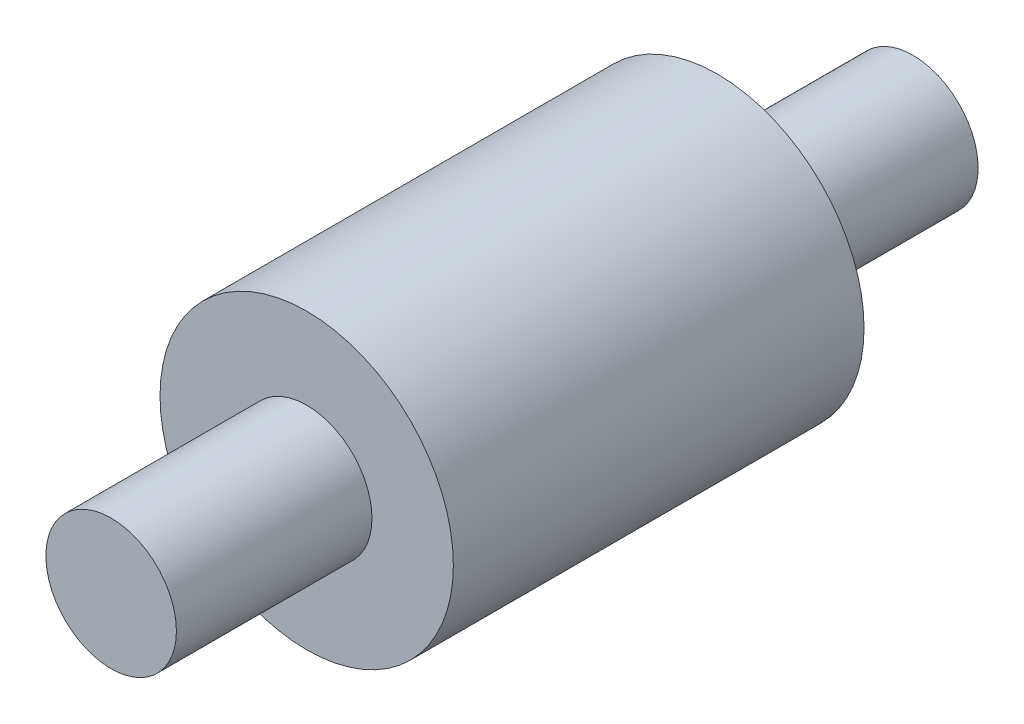
ISO-10303-21;
HEADER;
FILE_DESCRIPTION(('STEP AP214'),'2;1');
FILE_NAME('part.step','',(''),(''),'','','');
FILE_SCHEMA(('AUTOMOTIVE_DESIGN { 1 0 10303 214 1 1 1 1 }'));
ENDSEC;
DATA;
#1=APPLICATION_CONTEXT('core data for automotive mechanical design processes');
#2=APPLICATION_PROTOCOL_DEFINITION('international standard','automotive_design',2000,#1);
#3=PRODUCT_CONTEXT('',#1,'mechanical');
#4=PRODUCT('Part','Part','',(#3));
#5=PRODUCT_RELATED_PRODUCT_CATEGORY('part','',(#4));
#6=PRODUCT_DEFINITION_FORMATION('','',#4);
#7=PRODUCT_DEFINITION_CONTEXT('part definition',#1,'design');
#8=PRODUCT_DEFINITION('design','',#6,#7);
#9=PRODUCT_DEFINITION_SHAPE('','',#8);
#10=(LENGTH_UNIT() NAMED_UNIT(*) SI_UNIT(.MILLI.,.METRE.));
#11=(NAMED_UNIT(*) PLANE_ANGLE_UNIT() SI_UNIT($,.RADIAN.));
#12=(NAMED_UNIT(*) SI_UNIT($,.STERADIAN.) SOLID_ANGLE_UNIT());
#13=UNCERTAINTY_MEASURE_WITH_UNIT(LENGTH_MEASURE(1.E-05),#10,'distance_accuracy_value','');
#14=(GEOMETRIC_REPRESENTATION_CONTEXT(3) GLOBAL_UNCERTAINTY_ASSIGNED_CONTEXT((#13)) GLOBAL_UNIT_ASSIGNED_CONTEXT((#10,
#11,#12)) REPRESENTATION_CONTEXT('',''));
#15=CARTESIAN_POINT('',(0.,0.,0.));
#16=DIRECTION('',(0.,0.,1.));
#17=DIRECTION('',(1.,0.,0.));
#18=AXIS2_PLACEMENT_3D('',#15,#16,#17);
#19=CARTESIAN_POINT('',(0.,0.,6.3));
#20=DIRECTION('',(0.,0.,-1.));
#21=DIRECTION('',(-1.,0.,0.));
#22=AXIS2_PLACEMENT_3D('',#19,#20,#21);
#23=CYLINDRICAL_SURFACE('',#22,2.25);
#24=CARTESIAN_POINT('',(0.,0.,6.3));
#25=DIRECTION('',(0.,0.,1.));
#26=DIRECTION('',(1.,0.,0.));
#27=AXIS2_PLACEMENT_3D('',#24,#25,#26);
#28=CIRCLE('',#27,2.25);
#29=CARTESIAN_POINT('',(2.25,0.,6.3));
#30=VERTEX_POINT('',#29);
#31=EDGE_CURVE('E55',#30,#30,#28,.T.);
#32=ORIENTED_EDGE('',*,*,#31,.F.);
#33=EDGE_LOOP('',(#32));
#34=FACE_BOUND('',#33,.T.);
#35=CARTESIAN_POINT('',(0.,0.,0.));
#36=DIRECTION('',(0.,0.,1.));
#37=DIRECTION('',(1.,0.,0.));
#38=AXIS2_PLACEMENT_3D('',#35,#36,#37);
#39=CIRCLE('',#38,2.25);
#40=CARTESIAN_POINT('',(2.25,0.,0.));
#41=VERTEX_POINT('',#40);
#42=EDGE_CURVE('E44',#41,#41,#39,.T.);
#43=ORIENTED_EDGE('',*,*,#42,.T.);
#44=EDGE_LOOP('',(#43));
#45=FACE_BOUND('',#44,.T.);
#46=ADVANCED_FACE('F41',(#34,#45),#23,.T.);
#47=CARTESIAN_POINT('',(0.,0.,6.3));
#48=DIRECTION('',(0.,0.,1.));
#49=DIRECTION('',(1.,0.,0.));
#50=AXIS2_PLACEMENT_3D('',#47,#48,#49);
#51=PLANE('',#50);
#52=CARTESIAN_POINT('',(0.,0.,6.3));
#53=DIRECTION('',(0.,0.,1.));
#54=DIRECTION('',(1.,0.,0.));
#55=AXIS2_PLACEMENT_3D('',#52,#53,#54);
#56=CIRCLE('',#55,1.00121614606508);
#57=CARTESIAN_POINT('',(1.00121614606508,0.,6.3));
#58=VERTEX_POINT('',#57);
#59=EDGE_CURVE('E49',#58,#58,#56,.T.);
#60=ORIENTED_EDGE('',*,*,#59,.F.);
#61=EDGE_LOOP('',(#60));
#62=FACE_BOUND('',#61,.T.);
#63=ORIENTED_EDGE('',*,*,#31,.T.);
#64=EDGE_LOOP('',(#63));
#65=FACE_BOUND('',#64,.T.);
#66=ADVANCED_FACE('F75',(#62,#65),#51,.T.);
#67=CARTESIAN_POINT('',(0.,0.,0.));
#68=DIRECTION('',(0.,0.,1.));
#69=DIRECTION('',(1.,0.,0.));
#70=AXIS2_PLACEMENT_3D('',#67,#68,#69);
#71=PLANE('',#70);
#72=CARTESIAN_POINT('',(0.,0.,0.));
#73=DIRECTION('',(0.,0.,-1.));
#74=DIRECTION('',(-1.,0.,0.));
#75=AXIS2_PLACEMENT_3D('',#72,#73,#74);
#76=CIRCLE('',#75,1.);
#77=CARTESIAN_POINT('',(-1.,0.,0.));
#78=VERTEX_POINT('',#77);
#79=EDGE_CURVE('E10',#78,#78,#76,.T.);
#80=ORIENTED_EDGE('',*,*,#79,.F.);
#81=EDGE_LOOP('',(#80));
#82=FACE_BOUND('',#81,.T.);
#83=ORIENTED_EDGE('',*,*,#42,.F.);
#84=EDGE_LOOP('',(#83));
#85=FACE_BOUND('',#84,.T.);
#86=ADVANCED_FACE('F72',(#82,#85),#71,.F.);
#87=CARTESIAN_POINT('',(0.,0.,9.3));
#88=DIRECTION('',(0.,0.,-1.));
#89=DIRECTION('',(-1.,0.,0.));
#90=AXIS2_PLACEMENT_3D('',#87,#88,#89);
#91=CYLINDRICAL_SURFACE('',#90,1.00121614606508);
#92=CARTESIAN_POINT('',(0.,0.,9.3));
#93=DIRECTION('',(0.,0.,1.));
#94=DIRECTION('',(1.,0.,0.));
#95=AXIS2_PLACEMENT_3D('',#92,#93,#94);
#96=CIRCLE('',#95,1.00121614606508);
#97=CARTESIAN_POINT('',(1.00121614606508,0.,9.3));
#98=VERTEX_POINT('',#97);
#99=EDGE_CURVE('E60',#98,#98,#96,.T.);
#100=ORIENTED_EDGE('',*,*,#99,.F.);
#101=EDGE_LOOP('',(#100));
#102=FACE_BOUND('',#101,.T.);
#103=ORIENTED_EDGE('',*,*,#59,.T.);
#104=EDGE_LOOP('',(#103));
#105=FACE_BOUND('',#104,.T.);
#106=ADVANCED_FACE('F74',(#102,#105),#91,.T.);
#107=CARTESIAN_POINT('',(0.,0.,9.3));
#108=DIRECTION('',(0.,0.,1.));
#109=DIRECTION('',(1.,0.,0.));
#110=AXIS2_PLACEMENT_3D('',#107,#108,#109);
#111=PLANE('',#110);
#112=ORIENTED_EDGE('',*,*,#99,.T.);
#113=EDGE_LOOP('',(#112));
#114=FACE_BOUND('',#113,.T.);
#115=ADVANCED_FACE('F81',(#114),#111,.T.);
#116=CARTESIAN_POINT('',(0.,0.,-3.));
#117=DIRECTION('',(0.,0.,1.));
#118=DIRECTION('',(1.,0.,0.));
#119=AXIS2_PLACEMENT_3D('',#116,#117,#118);
#120=CYLINDRICAL_SURFACE('',#119,1.);
#121=CARTESIAN_POINT('',(0.,0.,-3.));
#122=DIRECTION('',(0.,0.,-1.));
#123=DIRECTION('',(-1.,0.,0.));
#124=AXIS2_PLACEMENT_3D('',#121,#122,#123);
#125=CIRCLE('',#124,1.);
#126=CARTESIAN_POINT('',(-1.,0.,-3.));
#127=VERTEX_POINT('',#126);
#128=EDGE_CURVE('E59',#127,#127,#125,.T.);
#129=ORIENTED_EDGE('',*,*,#128,.F.);
#130=EDGE_LOOP('',(#129));
#131=FACE_BOUND('',#130,.T.);
#132=ORIENTED_EDGE('',*,*,#79,.T.);
#133=EDGE_LOOP('',(#132));
#134=FACE_BOUND('',#133,.T.);
#135=ADVANCED_FACE('F111',(#131,#134),#120,.T.);
#136=CARTESIAN_POINT('',(0.,0.,-3.));
#137=DIRECTION('',(0.,0.,-1.));
#138=DIRECTION('',(-1.,0.,0.));
#139=AXIS2_PLACEMENT_3D('',#136,#137,#138);
#140=PLANE('',#139);
#141=ORIENTED_EDGE('',*,*,#128,.T.);
#142=EDGE_LOOP('',(#141));
#143=FACE_BOUND('',#142,.T.);
#144=ADVANCED_FACE('F127',(#143),#140,.T.);
#145=CLOSED_SHELL('',(#46,#66,#86,#106,#115,#135,#144));
#146=MANIFOLD_SOLID_BREP('B2',#145);
#147=ADVANCED_BREP_SHAPE_REPRESENTATION('',(#18,#146),#14);
#148=SHAPE_DEFINITION_REPRESENTATION(#9,#147);
ENDSEC;
END-ISO-10303-21;
